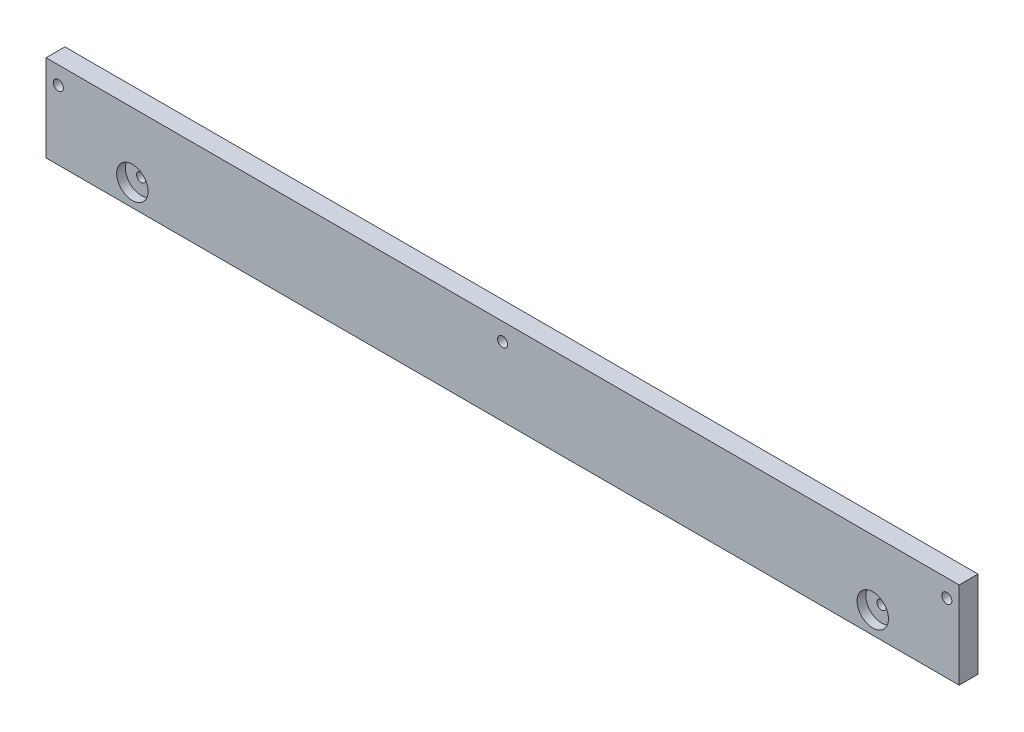
ISO-10303-21;
HEADER;
FILE_DESCRIPTION(('STEP AP214'),'2;1');
FILE_NAME('part.step','',(''),(''),'','','');
FILE_SCHEMA(('AUTOMOTIVE_DESIGN { 1 0 10303 214 1 1 1 1 }'));
ENDSEC;
DATA;
#1=APPLICATION_CONTEXT('core data for automotive mechanical design processes');
#2=APPLICATION_PROTOCOL_DEFINITION('international standard','automotive_design',2000,#1);
#3=PRODUCT_CONTEXT('',#1,'mechanical');
#4=PRODUCT('Part','Part','',(#3));
#5=PRODUCT_RELATED_PRODUCT_CATEGORY('part','',(#4));
#6=PRODUCT_DEFINITION_FORMATION('','',#4);
#7=PRODUCT_DEFINITION_CONTEXT('part definition',#1,'design');
#8=PRODUCT_DEFINITION('design','',#6,#7);
#9=PRODUCT_DEFINITION_SHAPE('','',#8);
#10=(LENGTH_UNIT() NAMED_UNIT(*) SI_UNIT(.MILLI.,.METRE.));
#11=(NAMED_UNIT(*) PLANE_ANGLE_UNIT() SI_UNIT($,.RADIAN.));
#12=(NAMED_UNIT(*) SI_UNIT($,.STERADIAN.) SOLID_ANGLE_UNIT());
#13=UNCERTAINTY_MEASURE_WITH_UNIT(LENGTH_MEASURE(1.E-05),#10,'distance_accuracy_value','');
#14=(GEOMETRIC_REPRESENTATION_CONTEXT(3) GLOBAL_UNCERTAINTY_ASSIGNED_CONTEXT((#13)) GLOBAL_UNIT_ASSIGNED_CONTEXT((#10,
#11,#12)) REPRESENTATION_CONTEXT('',''));
#15=CARTESIAN_POINT('',(0.,0.,0.));
#16=DIRECTION('',(0.,0.,1.));
#17=DIRECTION('',(1.,0.,0.));
#18=AXIS2_PLACEMENT_3D('',#15,#16,#17);
#19=CARTESIAN_POINT('',(-3.92699081749999,0.,6.));
#20=DIRECTION('',(0.,0.,1.));
#21=DIRECTION('',(1.,0.,0.));
#22=AXIS2_PLACEMENT_3D('',#19,#20,#21);
#23=PLANE('',#22);
#24=CARTESIAN_POINT('',(259.181393955,6.99999999999988,6.));
#25=DIRECTION('',(0.,0.,1.));
#26=DIRECTION('',(1.,0.,0.));
#27=AXIS2_PLACEMENT_3D('',#24,#25,#26);
#28=CIRCLE('',#27,4.99999999999999);
#29=CARTESIAN_POINT('',(264.181393955,6.99999999999988,6.));
#30=VERTEX_POINT('',#29);
#31=EDGE_CURVE('E314',#30,#30,#28,.T.);
#32=ORIENTED_EDGE('',*,*,#31,.F.);
#33=EDGE_LOOP('',(#32));
#34=FACE_BOUND('',#33,.T.);
#35=CARTESIAN_POINT('',(23.561944905,7.,6.));
#36=DIRECTION('',(0.,0.,1.));
#37=DIRECTION('',(1.,0.,0.));
#38=AXIS2_PLACEMENT_3D('',#35,#36,#37);
#39=CIRCLE('',#38,5.);
#40=CARTESIAN_POINT('',(28.561944905,7.,6.));
#41=VERTEX_POINT('',#40);
#42=EDGE_CURVE('E320',#41,#41,#39,.T.);
#43=ORIENTED_EDGE('',*,*,#42,.F.);
#44=EDGE_LOOP('',(#43));
#45=FACE_BOUND('',#44,.T.);
#46=CARTESIAN_POINT('',(141.37315521,21.9999999999999,6.));
#47=DIRECTION('',(0.,0.,1.));
#48=DIRECTION('',(1.,0.,0.));
#49=AXIS2_PLACEMENT_3D('',#46,#47,#48);
#50=CIRCLE('',#49,1.59999999999999);
#51=CARTESIAN_POINT('',(142.97315521,21.9999999999999,6.));
#52=VERTEX_POINT('',#51);
#53=EDGE_CURVE('E132',#52,#52,#50,.T.);
#54=ORIENTED_EDGE('',*,*,#53,.F.);
#55=EDGE_LOOP('',(#54));
#56=FACE_BOUND('',#55,.T.);
#57=DIRECTION('',(0.,-1.,0.));
#58=VECTOR('',#57,1.);
#59=CARTESIAN_POINT('',(-3.92699081749999,27.625,6.));
#60=LINE('',#59,#58);
#61=CARTESIAN_POINT('',(-3.92699081749999,27.625,6.));
#62=VERTEX_POINT('',#61);
#63=CARTESIAN_POINT('',(-3.92699081749999,0.,6.));
#64=VERTEX_POINT('',#63);
#65=EDGE_CURVE('E106',#62,#64,#60,.T.);
#66=ORIENTED_EDGE('',*,*,#65,.T.);
#67=DIRECTION('',(1.,0.,0.));
#68=VECTOR('',#67,1.);
#69=CARTESIAN_POINT('',(-3.92699081749999,0.,6.));
#70=LINE('',#69,#68);
#71=CARTESIAN_POINT('',(286.6703296775,0.,6.));
#72=VERTEX_POINT('',#71);
#73=EDGE_CURVE('E91',#64,#72,#70,.T.);
#74=ORIENTED_EDGE('',*,*,#73,.T.);
#75=DIRECTION('',(0.,1.,0.));
#76=VECTOR('',#75,1.);
#77=CARTESIAN_POINT('',(286.6703296775,27.625,6.));
#78=LINE('',#77,#76);
#79=CARTESIAN_POINT('',(286.6703296775,27.625,6.));
#80=VERTEX_POINT('',#79);
#81=EDGE_CURVE('E57',#72,#80,#78,.T.);
#82=ORIENTED_EDGE('',*,*,#81,.T.);
#83=DIRECTION('',(-1.,0.,0.));
#84=VECTOR('',#83,1.);
#85=CARTESIAN_POINT('',(-3.92699081749999,27.625,6.));
#86=LINE('',#85,#84);
#87=EDGE_CURVE('E52',#80,#62,#86,.T.);
#88=ORIENTED_EDGE('',*,*,#87,.T.);
#89=EDGE_LOOP('',(#66,#74,#82,#88));
#90=FACE_BOUND('',#89,.T.);
#91=CARTESIAN_POINT('',(0.,21.9999999999999,6.));
#92=DIRECTION('',(0.,0.,1.));
#93=DIRECTION('',(1.,0.,0.));
#94=AXIS2_PLACEMENT_3D('',#91,#92,#93);
#95=CIRCLE('',#94,1.6);
#96=CARTESIAN_POINT('',(1.6,21.9999999999999,6.));
#97=VERTEX_POINT('',#96);
#98=EDGE_CURVE('E96',#97,#97,#95,.T.);
#99=ORIENTED_EDGE('',*,*,#98,.F.);
#100=EDGE_LOOP('',(#99));
#101=FACE_BOUND('',#100,.T.);
#102=CARTESIAN_POINT('',(282.74333886,21.9999999999998,6.));
#103=DIRECTION('',(0.,0.,1.));
#104=DIRECTION('',(1.,0.,0.));
#105=AXIS2_PLACEMENT_3D('',#102,#103,#104);
#106=CIRCLE('',#105,1.59999999999996);
#107=CARTESIAN_POINT('',(284.34333886,21.9999999999998,6.));
#108=VERTEX_POINT('',#107);
#109=EDGE_CURVE('E126',#108,#108,#106,.T.);
#110=ORIENTED_EDGE('',*,*,#109,.F.);
#111=EDGE_LOOP('',(#110));
#112=FACE_BOUND('',#111,.T.);
#113=ADVANCED_FACE('F37',(#34,#45,#56,#90,#101,#112),#23,.T.);
#114=CARTESIAN_POINT('',(-3.92699081749999,0.,0.));
#115=DIRECTION('',(0.,0.,1.));
#116=DIRECTION('',(1.,0.,0.));
#117=AXIS2_PLACEMENT_3D('',#114,#115,#116);
#118=PLANE('',#117);
#119=CARTESIAN_POINT('',(141.37315521,21.9999999999999,0.));
#120=DIRECTION('',(0.,0.,1.));
#121=DIRECTION('',(1.,0.,0.));
#122=AXIS2_PLACEMENT_3D('',#119,#120,#121);
#123=CIRCLE('',#122,1.59999999999999);
#124=CARTESIAN_POINT('',(142.97315521,21.9999999999999,0.));
#125=VERTEX_POINT('',#124);
#126=EDGE_CURVE('E128',#125,#125,#123,.T.);
#127=ORIENTED_EDGE('',*,*,#126,.T.);
#128=EDGE_LOOP('',(#127));
#129=FACE_BOUND('',#128,.T.);
#130=DIRECTION('',(0.,-1.,0.));
#131=VECTOR('',#130,1.);
#132=CARTESIAN_POINT('',(-3.92699081749999,27.625,0.));
#133=LINE('',#132,#131);
#134=CARTESIAN_POINT('',(-3.92699081749999,27.625,0.));
#135=VERTEX_POINT('',#134);
#136=CARTESIAN_POINT('',(-3.92699081749999,0.,0.));
#137=VERTEX_POINT('',#136);
#138=EDGE_CURVE('E83',#135,#137,#133,.T.);
#139=ORIENTED_EDGE('',*,*,#138,.F.);
#140=DIRECTION('',(-1.,0.,0.));
#141=VECTOR('',#140,1.);
#142=CARTESIAN_POINT('',(-3.92699081749999,27.625,0.));
#143=LINE('',#142,#141);
#144=CARTESIAN_POINT('',(286.6703296775,27.625,0.));
#145=VERTEX_POINT('',#144);
#146=EDGE_CURVE('E104',#145,#135,#143,.T.);
#147=ORIENTED_EDGE('',*,*,#146,.F.);
#148=DIRECTION('',(0.,1.,0.));
#149=VECTOR('',#148,1.);
#150=CARTESIAN_POINT('',(286.6703296775,27.625,0.));
#151=LINE('',#150,#149);
#152=CARTESIAN_POINT('',(286.6703296775,0.,0.));
#153=VERTEX_POINT('',#152);
#154=EDGE_CURVE('E84',#153,#145,#151,.T.);
#155=ORIENTED_EDGE('',*,*,#154,.F.);
#156=DIRECTION('',(1.,0.,0.));
#157=VECTOR('',#156,1.);
#158=CARTESIAN_POINT('',(-3.92699081749999,0.,0.));
#159=LINE('',#158,#157);
#160=EDGE_CURVE('E78',#137,#153,#159,.T.);
#161=ORIENTED_EDGE('',*,*,#160,.F.);
#162=EDGE_LOOP('',(#139,#147,#155,#161));
#163=FACE_BOUND('',#162,.T.);
#164=CARTESIAN_POINT('',(0.,21.9999999999999,0.));
#165=DIRECTION('',(0.,0.,1.));
#166=DIRECTION('',(1.,0.,0.));
#167=AXIS2_PLACEMENT_3D('',#164,#165,#166);
#168=CIRCLE('',#167,1.6);
#169=CARTESIAN_POINT('',(1.6,21.9999999999999,0.));
#170=VERTEX_POINT('',#169);
#171=EDGE_CURVE('E99',#170,#170,#168,.T.);
#172=ORIENTED_EDGE('',*,*,#171,.T.);
#173=EDGE_LOOP('',(#172));
#174=FACE_BOUND('',#173,.T.);
#175=CARTESIAN_POINT('',(282.74333886,21.9999999999998,0.));
#176=DIRECTION('',(0.,0.,1.));
#177=DIRECTION('',(1.,0.,0.));
#178=AXIS2_PLACEMENT_3D('',#175,#176,#177);
#179=CIRCLE('',#178,1.59999999999996);
#180=CARTESIAN_POINT('',(284.34333886,21.9999999999998,0.));
#181=VERTEX_POINT('',#180);
#182=EDGE_CURVE('E129',#181,#181,#179,.T.);
#183=ORIENTED_EDGE('',*,*,#182,.T.);
#184=EDGE_LOOP('',(#183));
#185=FACE_BOUND('',#184,.T.);
#186=ADVANCED_FACE('F79',(#129,#163,#174,#185),#118,.F.);
#187=CARTESIAN_POINT('',(-3.92699081749999,27.625,6.));
#188=DIRECTION('',(1.,0.,0.));
#189=DIRECTION('',(0.,0.,-1.));
#190=AXIS2_PLACEMENT_3D('',#187,#188,#189);
#191=PLANE('',#190);
#192=ORIENTED_EDGE('',*,*,#138,.T.);
#193=DIRECTION('',(0.,0.,-1.));
#194=VECTOR('',#193,1.);
#195=CARTESIAN_POINT('',(-3.92699081749999,0.,6.));
#196=LINE('',#195,#194);
#197=EDGE_CURVE('E11',#64,#137,#196,.T.);
#198=ORIENTED_EDGE('',*,*,#197,.F.);
#199=ORIENTED_EDGE('',*,*,#65,.F.);
#200=DIRECTION('',(0.,0.,-1.));
#201=VECTOR('',#200,1.);
#202=CARTESIAN_POINT('',(-3.92699081749999,27.625,6.));
#203=LINE('',#202,#201);
#204=EDGE_CURVE('E95',#62,#135,#203,.T.);
#205=ORIENTED_EDGE('',*,*,#204,.T.);
#206=EDGE_LOOP('',(#192,#198,#199,#205));
#207=FACE_BOUND('',#206,.T.);
#208=ADVANCED_FACE('F39',(#207),#191,.F.);
#209=CARTESIAN_POINT('',(-3.92699081749999,0.,6.));
#210=DIRECTION('',(0.,1.,0.));
#211=DIRECTION('',(0.,0.,1.));
#212=AXIS2_PLACEMENT_3D('',#209,#210,#211);
#213=PLANE('',#212);
#214=ORIENTED_EDGE('',*,*,#160,.T.);
#215=DIRECTION('',(0.,0.,-1.));
#216=VECTOR('',#215,1.);
#217=CARTESIAN_POINT('',(286.6703296775,0.,6.));
#218=LINE('',#217,#216);
#219=EDGE_CURVE('E45',#72,#153,#218,.T.);
#220=ORIENTED_EDGE('',*,*,#219,.F.);
#221=ORIENTED_EDGE('',*,*,#73,.F.);
#222=ORIENTED_EDGE('',*,*,#197,.T.);
#223=EDGE_LOOP('',(#214,#220,#221,#222));
#224=FACE_BOUND('',#223,.T.);
#225=ADVANCED_FACE('F90',(#224),#213,.F.);
#226=CARTESIAN_POINT('',(286.6703296775,27.625,6.));
#227=DIRECTION('',(-1.,0.,0.));
#228=DIRECTION('',(0.,0.,1.));
#229=AXIS2_PLACEMENT_3D('',#226,#227,#228);
#230=PLANE('',#229);
#231=ORIENTED_EDGE('',*,*,#154,.T.);
#232=DIRECTION('',(0.,0.,-1.));
#233=VECTOR('',#232,1.);
#234=CARTESIAN_POINT('',(286.6703296775,27.625,6.));
#235=LINE('',#234,#233);
#236=EDGE_CURVE('E112',#80,#145,#235,.T.);
#237=ORIENTED_EDGE('',*,*,#236,.F.);
#238=ORIENTED_EDGE('',*,*,#81,.F.);
#239=ORIENTED_EDGE('',*,*,#219,.T.);
#240=EDGE_LOOP('',(#231,#237,#238,#239));
#241=FACE_BOUND('',#240,.T.);
#242=ADVANCED_FACE('F115',(#241),#230,.F.);
#243=CARTESIAN_POINT('',(-3.92699081749999,27.625,6.));
#244=DIRECTION('',(0.,-1.,0.));
#245=DIRECTION('',(0.,0.,-1.));
#246=AXIS2_PLACEMENT_3D('',#243,#244,#245);
#247=PLANE('',#246);
#248=ORIENTED_EDGE('',*,*,#146,.T.);
#249=ORIENTED_EDGE('',*,*,#204,.F.);
#250=ORIENTED_EDGE('',*,*,#87,.F.);
#251=ORIENTED_EDGE('',*,*,#236,.T.);
#252=EDGE_LOOP('',(#248,#249,#250,#251));
#253=FACE_BOUND('',#252,.T.);
#254=ADVANCED_FACE('F117',(#253),#247,.F.);
#255=CARTESIAN_POINT('',(0.,21.9999999999999,6.));
#256=DIRECTION('',(0.,0.,-1.));
#257=DIRECTION('',(-1.,0.,0.));
#258=AXIS2_PLACEMENT_3D('',#255,#256,#257);
#259=CYLINDRICAL_SURFACE('',#258,1.6);
#260=ORIENTED_EDGE('',*,*,#98,.T.);
#261=EDGE_LOOP('',(#260));
#262=FACE_BOUND('',#261,.T.);
#263=ORIENTED_EDGE('',*,*,#171,.F.);
#264=EDGE_LOOP('',(#263));
#265=FACE_BOUND('',#264,.T.);
#266=ADVANCED_FACE('F144',(#262,#265),#259,.F.);
#267=CARTESIAN_POINT('',(141.37315521,21.9999999999999,6.));
#268=DIRECTION('',(0.,0.,-1.));
#269=DIRECTION('',(-1.,0.,0.));
#270=AXIS2_PLACEMENT_3D('',#267,#268,#269);
#271=CYLINDRICAL_SURFACE('',#270,1.59999999999999);
#272=ORIENTED_EDGE('',*,*,#53,.T.);
#273=EDGE_LOOP('',(#272));
#274=FACE_BOUND('',#273,.T.);
#275=ORIENTED_EDGE('',*,*,#126,.F.);
#276=EDGE_LOOP('',(#275));
#277=FACE_BOUND('',#276,.T.);
#278=ADVANCED_FACE('F146',(#274,#277),#271,.F.);
#279=CARTESIAN_POINT('',(282.74333886,21.9999999999998,6.));
#280=DIRECTION('',(0.,0.,-1.));
#281=DIRECTION('',(-1.,0.,0.));
#282=AXIS2_PLACEMENT_3D('',#279,#280,#281);
#283=CYLINDRICAL_SURFACE('',#282,1.59999999999996);
#284=ORIENTED_EDGE('',*,*,#109,.T.);
#285=EDGE_LOOP('',(#284));
#286=FACE_BOUND('',#285,.T.);
#287=ORIENTED_EDGE('',*,*,#182,.F.);
#288=EDGE_LOOP('',(#287));
#289=FACE_BOUND('',#288,.T.);
#290=ADVANCED_FACE('F153',(#286,#289),#283,.F.);
#291=CARTESIAN_POINT('',(23.561944905,7.,3.2));
#292=DIRECTION('',(0.,0.,1.));
#293=DIRECTION('',(1.,0.,0.));
#294=AXIS2_PLACEMENT_3D('',#291,#292,#293);
#295=CYLINDRICAL_SURFACE('',#294,5.);
#296=CARTESIAN_POINT('',(23.561944905,7.,3.2));
#297=DIRECTION('',(0.,0.,1.));
#298=DIRECTION('',(1.,0.,0.));
#299=AXIS2_PLACEMENT_3D('',#296,#297,#298);
#300=CIRCLE('',#299,5.);
#301=CARTESIAN_POINT('',(28.561944905,7.,3.2));
#302=VERTEX_POINT('',#301);
#303=EDGE_CURVE('E135',#302,#302,#300,.T.);
#304=ORIENTED_EDGE('',*,*,#303,.F.);
#305=EDGE_LOOP('',(#304));
#306=FACE_BOUND('',#305,.T.);
#307=ORIENTED_EDGE('',*,*,#42,.T.);
#308=EDGE_LOOP('',(#307));
#309=FACE_BOUND('',#308,.T.);
#310=ADVANCED_FACE('F187',(#306,#309),#295,.F.);
#311=CARTESIAN_POINT('',(23.561944905,7.,3.2));
#312=DIRECTION('',(0.,0.,1.));
#313=DIRECTION('',(1.,0.,0.));
#314=AXIS2_PLACEMENT_3D('',#311,#312,#313);
#315=PLANE('',#314);
#316=CARTESIAN_POINT('',(23.561944905,7.,3.2));
#317=DIRECTION('',(0.,0.,1.));
#318=DIRECTION('',(1.,0.,0.));
#319=AXIS2_PLACEMENT_3D('',#316,#317,#318);
#320=CIRCLE('',#319,1.45);
#321=CARTESIAN_POINT('',(25.011944905,7.,3.2));
#322=VERTEX_POINT('',#321);
#323=EDGE_CURVE('E303',#322,#322,#320,.T.);
#324=ORIENTED_EDGE('',*,*,#323,.F.);
#325=EDGE_LOOP('',(#324));
#326=FACE_BOUND('',#325,.T.);
#327=ORIENTED_EDGE('',*,*,#303,.T.);
#328=EDGE_LOOP('',(#327));
#329=FACE_BOUND('',#328,.T.);
#330=ADVANCED_FACE('F192',(#326,#329),#315,.T.);
#331=CARTESIAN_POINT('',(259.181393955,6.99999999999988,3.2));
#332=DIRECTION('',(0.,0.,1.));
#333=DIRECTION('',(1.,0.,0.));
#334=AXIS2_PLACEMENT_3D('',#331,#332,#333);
#335=CYLINDRICAL_SURFACE('',#334,4.99999999999999);
#336=CARTESIAN_POINT('',(259.181393955,6.99999999999988,3.2));
#337=DIRECTION('',(0.,0.,1.));
#338=DIRECTION('',(1.,0.,0.));
#339=AXIS2_PLACEMENT_3D('',#336,#337,#338);
#340=CIRCLE('',#339,4.99999999999999);
#341=CARTESIAN_POINT('',(264.181393955,6.99999999999988,3.2));
#342=VERTEX_POINT('',#341);
#343=EDGE_CURVE('E317',#342,#342,#340,.T.);
#344=ORIENTED_EDGE('',*,*,#343,.F.);
#345=EDGE_LOOP('',(#344));
#346=FACE_BOUND('',#345,.T.);
#347=ORIENTED_EDGE('',*,*,#31,.T.);
#348=EDGE_LOOP('',(#347));
#349=FACE_BOUND('',#348,.T.);
#350=ADVANCED_FACE('F200',(#346,#349),#335,.F.);
#351=CARTESIAN_POINT('',(259.181393955,6.99999999999988,3.2));
#352=DIRECTION('',(0.,0.,1.));
#353=DIRECTION('',(1.,0.,0.));
#354=AXIS2_PLACEMENT_3D('',#351,#352,#353);
#355=PLANE('',#354);
#356=CARTESIAN_POINT('',(259.181393955,6.99999999999988,3.2));
#357=DIRECTION('',(0.,0.,1.));
#358=DIRECTION('',(1.,0.,0.));
#359=AXIS2_PLACEMENT_3D('',#356,#357,#358);
#360=CIRCLE('',#359,1.45);
#361=CARTESIAN_POINT('',(260.631393955,6.99999999999988,3.2));
#362=VERTEX_POINT('',#361);
#363=EDGE_CURVE('E304',#362,#362,#360,.T.);
#364=ORIENTED_EDGE('',*,*,#363,.F.);
#365=EDGE_LOOP('',(#364));
#366=FACE_BOUND('',#365,.T.);
#367=ORIENTED_EDGE('',*,*,#343,.T.);
#368=EDGE_LOOP('',(#367));
#369=FACE_BOUND('',#368,.T.);
#370=ADVANCED_FACE('F205',(#366,#369),#355,.T.);
#371=CARTESIAN_POINT('',(23.561944905,7.,0.7));
#372=DIRECTION('',(0.,0.,1.));
#373=DIRECTION('',(1.,0.,0.));
#374=AXIS2_PLACEMENT_3D('',#371,#372,#373);
#375=CYLINDRICAL_SURFACE('',#374,1.45);
#376=CARTESIAN_POINT('',(23.561944905,7.,0.7));
#377=DIRECTION('',(0.,0.,1.));
#378=DIRECTION('',(1.,0.,0.));
#379=AXIS2_PLACEMENT_3D('',#376,#377,#378);
#380=CIRCLE('',#379,1.45);
#381=CARTESIAN_POINT('',(25.011944905,7.,0.7));
#382=VERTEX_POINT('',#381);
#383=EDGE_CURVE('E307',#382,#382,#380,.T.);
#384=ORIENTED_EDGE('',*,*,#383,.F.);
#385=EDGE_LOOP('',(#384));
#386=FACE_BOUND('',#385,.T.);
#387=ORIENTED_EDGE('',*,*,#323,.T.);
#388=EDGE_LOOP('',(#387));
#389=FACE_BOUND('',#388,.T.);
#390=ADVANCED_FACE('F222',(#386,#389),#375,.F.);
#391=CARTESIAN_POINT('',(23.561944905,7.,0.7));
#392=DIRECTION('',(0.,0.,1.));
#393=DIRECTION('',(1.,0.,0.));
#394=AXIS2_PLACEMENT_3D('',#391,#392,#393);
#395=PLANE('',#394);
#396=ORIENTED_EDGE('',*,*,#383,.T.);
#397=EDGE_LOOP('',(#396));
#398=FACE_BOUND('',#397,.T.);
#399=ADVANCED_FACE('F232',(#398),#395,.T.);
#400=CARTESIAN_POINT('',(259.181393955,6.99999999999988,0.7));
#401=DIRECTION('',(0.,0.,1.));
#402=DIRECTION('',(1.,0.,0.));
#403=AXIS2_PLACEMENT_3D('',#400,#401,#402);
#404=CYLINDRICAL_SURFACE('',#403,1.45);
#405=CARTESIAN_POINT('',(259.181393955,6.99999999999988,0.7));
#406=DIRECTION('',(0.,0.,1.));
#407=DIRECTION('',(1.,0.,0.));
#408=AXIS2_PLACEMENT_3D('',#405,#406,#407);
#409=CIRCLE('',#408,1.45);
#410=CARTESIAN_POINT('',(260.631393955,6.99999999999988,0.7));
#411=VERTEX_POINT('',#410);
#412=EDGE_CURVE('E302',#411,#411,#409,.T.);
#413=ORIENTED_EDGE('',*,*,#412,.F.);
#414=EDGE_LOOP('',(#413));
#415=FACE_BOUND('',#414,.T.);
#416=ORIENTED_EDGE('',*,*,#363,.T.);
#417=EDGE_LOOP('',(#416));
#418=FACE_BOUND('',#417,.T.);
#419=ADVANCED_FACE('F242',(#415,#418),#404,.F.);
#420=CARTESIAN_POINT('',(259.181393955,6.99999999999988,0.7));
#421=DIRECTION('',(0.,0.,1.));
#422=DIRECTION('',(1.,0.,0.));
#423=AXIS2_PLACEMENT_3D('',#420,#421,#422);
#424=PLANE('',#423);
#425=ORIENTED_EDGE('',*,*,#412,.T.);
#426=EDGE_LOOP('',(#425));
#427=FACE_BOUND('',#426,.T.);
#428=ADVANCED_FACE('F252',(#427),#424,.T.);
#429=CLOSED_SHELL('',(#113,#186,#208,#225,#242,#254,#266,#278,#290,#310,#330,#350,#370,#390,
#399,#419,#428));
#430=MANIFOLD_SOLID_BREP('B2',#429);
#431=ADVANCED_BREP_SHAPE_REPRESENTATION('',(#18,#430),#14);
#432=SHAPE_DEFINITION_REPRESENTATION(#9,#431);
ENDSEC;
END-ISO-10303-21;
